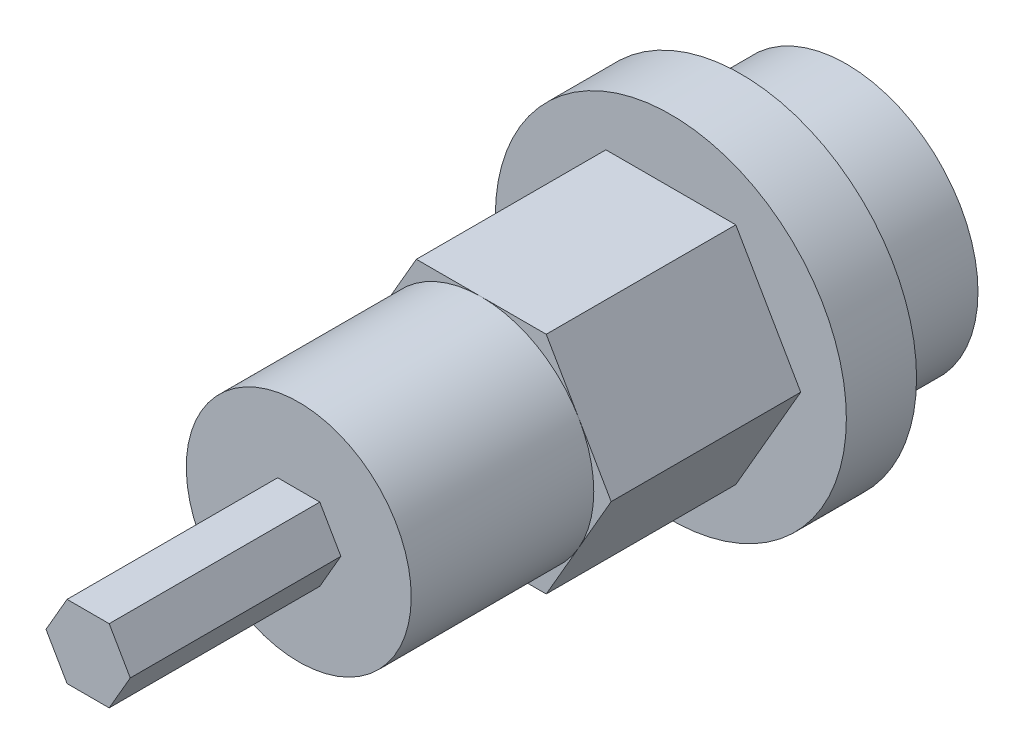
ISO-10303-21;
HEADER;
FILE_DESCRIPTION(('STEP AP214'),'2;1');
FILE_NAME('part.step','',(''),(''),'','','');
FILE_SCHEMA(('AUTOMOTIVE_DESIGN { 1 0 10303 214 1 1 1 1 }'));
ENDSEC;
DATA;
#1=APPLICATION_CONTEXT('core data for automotive mechanical design processes');
#2=APPLICATION_PROTOCOL_DEFINITION('international standard','automotive_design',2000,#1);
#3=PRODUCT_CONTEXT('',#1,'mechanical');
#4=PRODUCT('Part','Part','',(#3));
#5=PRODUCT_RELATED_PRODUCT_CATEGORY('part','',(#4));
#6=PRODUCT_DEFINITION_FORMATION('','',#4);
#7=PRODUCT_DEFINITION_CONTEXT('part definition',#1,'design');
#8=PRODUCT_DEFINITION('design','',#6,#7);
#9=PRODUCT_DEFINITION_SHAPE('','',#8);
#10=(LENGTH_UNIT() NAMED_UNIT(*) SI_UNIT(.MILLI.,.METRE.));
#11=(NAMED_UNIT(*) PLANE_ANGLE_UNIT() SI_UNIT($,.RADIAN.));
#12=(NAMED_UNIT(*) SI_UNIT($,.STERADIAN.) SOLID_ANGLE_UNIT());
#13=UNCERTAINTY_MEASURE_WITH_UNIT(LENGTH_MEASURE(1.E-05),#10,'distance_accuracy_value','');
#14=(GEOMETRIC_REPRESENTATION_CONTEXT(3) GLOBAL_UNCERTAINTY_ASSIGNED_CONTEXT((#13)) GLOBAL_UNIT_ASSIGNED_CONTEXT((#10,
#11,#12)) REPRESENTATION_CONTEXT('',''));
#15=CARTESIAN_POINT('',(0.,0.,0.));
#16=DIRECTION('',(0.,0.,1.));
#17=DIRECTION('',(1.,0.,0.));
#18=AXIS2_PLACEMENT_3D('',#15,#16,#17);
#19=CARTESIAN_POINT('',(0.,0.,10.4));
#20=DIRECTION('',(0.,0.,1.));
#21=DIRECTION('',(1.,0.,0.));
#22=AXIS2_PLACEMENT_3D('',#19,#20,#21);
#23=PLANE('',#22);
#24=CARTESIAN_POINT('',(0.,0.,10.4));
#25=DIRECTION('',(0.,0.,1.));
#26=DIRECTION('',(1.,0.,0.));
#27=AXIS2_PLACEMENT_3D('',#24,#25,#26);
#28=CIRCLE('',#27,3.20429399400242);
#29=CARTESIAN_POINT('',(2.775,1.60214699700121,10.4));
#30=VERTEX_POINT('',#29);
#31=CARTESIAN_POINT('',(0.,3.20429399400243,10.4));
#32=VERTEX_POINT('',#31);
#33=EDGE_CURVE('E51',#30,#32,#28,.T.);
#34=ORIENTED_EDGE('',*,*,#33,.F.);
#35=DIRECTION('',(-0.5,0.866025403784439,0.));
#36=VECTOR('',#35,1.);
#37=CARTESIAN_POINT('',(3.7,0.,10.4));
#38=LINE('',#37,#36);
#39=CARTESIAN_POINT('',(1.85,3.20429399400242,10.4));
#40=VERTEX_POINT('',#39);
#41=EDGE_CURVE('E191',#30,#40,#38,.T.);
#42=ORIENTED_EDGE('',*,*,#41,.T.);
#43=DIRECTION('',(-1.,0.,0.));
#44=VECTOR('',#43,1.);
#45=CARTESIAN_POINT('',(1.85,3.20429399400242,10.4));
#46=LINE('',#45,#44);
#47=EDGE_CURVE('E197',#40,#32,#46,.T.);
#48=ORIENTED_EDGE('',*,*,#47,.T.);
#49=EDGE_LOOP('',(#34,#42,#48));
#50=FACE_BOUND('',#49,.T.);
#51=ADVANCED_FACE('F39',(#50),#23,.T.);
#52=CARTESIAN_POINT('',(-2.775,1.60214699700121,10.4));
#53=VERTEX_POINT('',#52);
#54=EDGE_CURVE('E11',#32,#53,#28,.T.);
#55=ORIENTED_EDGE('',*,*,#54,.F.);
#56=CARTESIAN_POINT('',(-1.85,3.20429399400243,10.4));
#57=VERTEX_POINT('',#56);
#58=EDGE_CURVE('E196',#32,#57,#46,.T.);
#59=ORIENTED_EDGE('',*,*,#58,.T.);
#60=DIRECTION('',(-0.5,-0.866025403784439,0.));
#61=VECTOR('',#60,1.);
#62=CARTESIAN_POINT('',(-1.85,3.20429399400243,10.4));
#63=LINE('',#62,#61);
#64=EDGE_CURVE('E202',#57,#53,#63,.T.);
#65=ORIENTED_EDGE('',*,*,#64,.T.);
#66=EDGE_LOOP('',(#55,#59,#65));
#67=FACE_BOUND('',#66,.T.);
#68=ADVANCED_FACE('F296',(#67),#23,.T.);
#69=CARTESIAN_POINT('',(-2.775,-1.60214699700121,10.4));
#70=VERTEX_POINT('',#69);
#71=EDGE_CURVE('E49',#53,#70,#28,.T.);
#72=ORIENTED_EDGE('',*,*,#71,.F.);
#73=CARTESIAN_POINT('',(-3.7,0.,10.4));
#74=VERTEX_POINT('',#73);
#75=EDGE_CURVE('E201',#53,#74,#63,.T.);
#76=ORIENTED_EDGE('',*,*,#75,.T.);
#77=DIRECTION('',(0.5,-0.866025403784439,0.));
#78=VECTOR('',#77,1.);
#79=CARTESIAN_POINT('',(-3.7,0.,10.4));
#80=LINE('',#79,#78);
#81=EDGE_CURVE('E207',#74,#70,#80,.T.);
#82=ORIENTED_EDGE('',*,*,#81,.T.);
#83=EDGE_LOOP('',(#72,#76,#82));
#84=FACE_BOUND('',#83,.T.);
#85=ADVANCED_FACE('F303',(#84),#23,.T.);
#86=CARTESIAN_POINT('',(0.,-3.20429399400242,10.4));
#87=VERTEX_POINT('',#86);
#88=EDGE_CURVE('E334',#70,#87,#28,.T.);
#89=ORIENTED_EDGE('',*,*,#88,.F.);
#90=CARTESIAN_POINT('',(-1.85,-3.20429399400242,10.4));
#91=VERTEX_POINT('',#90);
#92=EDGE_CURVE('E206',#70,#91,#80,.T.);
#93=ORIENTED_EDGE('',*,*,#92,.T.);
#94=DIRECTION('',(1.,0.,0.));
#95=VECTOR('',#94,1.);
#96=CARTESIAN_POINT('',(-1.85,-3.20429399400242,10.4));
#97=LINE('',#96,#95);
#98=EDGE_CURVE('E212',#91,#87,#97,.T.);
#99=ORIENTED_EDGE('',*,*,#98,.T.);
#100=EDGE_LOOP('',(#89,#93,#99));
#101=FACE_BOUND('',#100,.T.);
#102=ADVANCED_FACE('F321',(#101),#23,.T.);
#103=CARTESIAN_POINT('',(2.775,-1.60214699700121,10.4));
#104=VERTEX_POINT('',#103);
#105=EDGE_CURVE('E278',#87,#104,#28,.T.);
#106=ORIENTED_EDGE('',*,*,#105,.F.);
#107=CARTESIAN_POINT('',(1.85,-3.20429399400243,10.4));
#108=VERTEX_POINT('',#107);
#109=EDGE_CURVE('E211',#87,#108,#97,.T.);
#110=ORIENTED_EDGE('',*,*,#109,.T.);
#111=DIRECTION('',(0.5,0.866025403784439,0.));
#112=VECTOR('',#111,1.);
#113=CARTESIAN_POINT('',(1.85,-3.20429399400243,10.4));
#114=LINE('',#113,#112);
#115=EDGE_CURVE('E187',#108,#104,#114,.T.);
#116=ORIENTED_EDGE('',*,*,#115,.T.);
#117=EDGE_LOOP('',(#106,#110,#116));
#118=FACE_BOUND('',#117,.T.);
#119=ADVANCED_FACE('F293',(#118),#23,.T.);
#120=CARTESIAN_POINT('',(0.,0.,3.));
#121=DIRECTION('',(0.,0.,-1.));
#122=DIRECTION('',(-1.,0.,0.));
#123=AXIS2_PLACEMENT_3D('',#120,#121,#122);
#124=CYLINDRICAL_SURFACE('',#123,3.75);
#125=CARTESIAN_POINT('',(0.,0.,3.));
#126=DIRECTION('',(0.,0.,1.));
#127=DIRECTION('',(1.,0.,0.));
#128=AXIS2_PLACEMENT_3D('',#125,#126,#127);
#129=CIRCLE('',#128,3.75);
#130=CARTESIAN_POINT('',(3.75,0.,3.));
#131=VERTEX_POINT('',#130);
#132=EDGE_CURVE('E270',#131,#131,#129,.T.);
#133=ORIENTED_EDGE('',*,*,#132,.F.);
#134=EDGE_LOOP('',(#133));
#135=FACE_BOUND('',#134,.T.);
#136=CARTESIAN_POINT('',(0.,0.,0.));
#137=DIRECTION('',(0.,0.,1.));
#138=DIRECTION('',(1.,0.,0.));
#139=AXIS2_PLACEMENT_3D('',#136,#137,#138);
#140=CIRCLE('',#139,3.75);
#141=CARTESIAN_POINT('',(3.75,0.,0.));
#142=VERTEX_POINT('',#141);
#143=EDGE_CURVE('E43',#142,#142,#140,.T.);
#144=ORIENTED_EDGE('',*,*,#143,.T.);
#145=EDGE_LOOP('',(#144));
#146=FACE_BOUND('',#145,.T.);
#147=ADVANCED_FACE('F41',(#135,#146),#124,.T.);
#148=CARTESIAN_POINT('',(0.,0.,0.));
#149=DIRECTION('',(0.,0.,1.));
#150=DIRECTION('',(1.,0.,0.));
#151=AXIS2_PLACEMENT_3D('',#148,#149,#150);
#152=PLANE('',#151);
#153=ORIENTED_EDGE('',*,*,#143,.F.);
#154=EDGE_LOOP('',(#153));
#155=FACE_BOUND('',#154,.T.);
#156=ADVANCED_FACE('F283',(#155),#152,.F.);
#157=CARTESIAN_POINT('',(0.,0.,5.));
#158=DIRECTION('',(0.,0.,-1.));
#159=DIRECTION('',(-1.,0.,0.));
#160=AXIS2_PLACEMENT_3D('',#157,#158,#159);
#161=CYLINDRICAL_SURFACE('',#160,5.);
#162=CARTESIAN_POINT('',(0.,0.,5.));
#163=DIRECTION('',(0.,0.,1.));
#164=DIRECTION('',(1.,0.,0.));
#165=AXIS2_PLACEMENT_3D('',#162,#163,#164);
#166=CIRCLE('',#165,5.);
#167=CARTESIAN_POINT('',(5.,0.,5.));
#168=VERTEX_POINT('',#167);
#169=EDGE_CURVE('E264',#168,#168,#166,.T.);
#170=ORIENTED_EDGE('',*,*,#169,.F.);
#171=EDGE_LOOP('',(#170));
#172=FACE_BOUND('',#171,.T.);
#173=CARTESIAN_POINT('',(0.,0.,3.));
#174=DIRECTION('',(0.,0.,1.));
#175=DIRECTION('',(1.,0.,0.));
#176=AXIS2_PLACEMENT_3D('',#173,#174,#175);
#177=CIRCLE('',#176,5.);
#178=CARTESIAN_POINT('',(5.,0.,3.));
#179=VERTEX_POINT('',#178);
#180=EDGE_CURVE('E263',#179,#179,#177,.T.);
#181=ORIENTED_EDGE('',*,*,#180,.T.);
#182=EDGE_LOOP('',(#181));
#183=FACE_BOUND('',#182,.T.);
#184=ADVANCED_FACE('F285',(#172,#183),#161,.T.);
#185=CARTESIAN_POINT('',(0.,0.,5.));
#186=DIRECTION('',(0.,0.,1.));
#187=DIRECTION('',(1.,0.,0.));
#188=AXIS2_PLACEMENT_3D('',#185,#186,#187);
#189=PLANE('',#188);
#190=DIRECTION('',(0.5,0.866025403784439,0.));
#191=VECTOR('',#190,1.);
#192=CARTESIAN_POINT('',(1.85,-3.20429399400243,5.));
#193=LINE('',#192,#191);
#194=CARTESIAN_POINT('',(1.85,-3.20429399400243,5.));
#195=VERTEX_POINT('',#194);
#196=CARTESIAN_POINT('',(3.7,0.,5.));
#197=VERTEX_POINT('',#196);
#198=EDGE_CURVE('E185',#195,#197,#193,.T.);
#199=ORIENTED_EDGE('',*,*,#198,.F.);
#200=DIRECTION('',(1.,0.,0.));
#201=VECTOR('',#200,1.);
#202=CARTESIAN_POINT('',(-1.85,-3.20429399400242,5.));
#203=LINE('',#202,#201);
#204=CARTESIAN_POINT('',(-1.85,-3.20429399400242,5.));
#205=VERTEX_POINT('',#204);
#206=EDGE_CURVE('E236',#205,#195,#203,.T.);
#207=ORIENTED_EDGE('',*,*,#206,.F.);
#208=DIRECTION('',(0.5,-0.866025403784439,0.));
#209=VECTOR('',#208,1.);
#210=CARTESIAN_POINT('',(-3.7,0.,5.));
#211=LINE('',#210,#209);
#212=CARTESIAN_POINT('',(-3.7,0.,5.));
#213=VERTEX_POINT('',#212);
#214=EDGE_CURVE('E232',#213,#205,#211,.T.);
#215=ORIENTED_EDGE('',*,*,#214,.F.);
#216=DIRECTION('',(-0.5,-0.866025403784439,0.));
#217=VECTOR('',#216,1.);
#218=CARTESIAN_POINT('',(-1.85,3.20429399400243,5.));
#219=LINE('',#218,#217);
#220=CARTESIAN_POINT('',(-1.85,3.20429399400243,5.));
#221=VERTEX_POINT('',#220);
#222=EDGE_CURVE('E228',#221,#213,#219,.T.);
#223=ORIENTED_EDGE('',*,*,#222,.F.);
#224=DIRECTION('',(-1.,0.,0.));
#225=VECTOR('',#224,1.);
#226=CARTESIAN_POINT('',(1.85,3.20429399400242,5.));
#227=LINE('',#226,#225);
#228=CARTESIAN_POINT('',(1.85,3.20429399400242,5.));
#229=VERTEX_POINT('',#228);
#230=EDGE_CURVE('E224',#229,#221,#227,.T.);
#231=ORIENTED_EDGE('',*,*,#230,.F.);
#232=DIRECTION('',(-0.5,0.866025403784439,0.));
#233=VECTOR('',#232,1.);
#234=CARTESIAN_POINT('',(3.7,0.,5.));
#235=LINE('',#234,#233);
#236=EDGE_CURVE('E220',#197,#229,#235,.T.);
#237=ORIENTED_EDGE('',*,*,#236,.F.);
#238=EDGE_LOOP('',(#199,#207,#215,#223,#231,#237));
#239=FACE_BOUND('',#238,.T.);
#240=ORIENTED_EDGE('',*,*,#169,.T.);
#241=EDGE_LOOP('',(#240));
#242=FACE_BOUND('',#241,.T.);
#243=ADVANCED_FACE('F290',(#239,#242),#189,.T.);
#244=CARTESIAN_POINT('',(0.,0.,3.));
#245=DIRECTION('',(0.,0.,1.));
#246=DIRECTION('',(1.,0.,0.));
#247=AXIS2_PLACEMENT_3D('',#244,#245,#246);
#248=PLANE('',#247);
#249=ORIENTED_EDGE('',*,*,#132,.T.);
#250=EDGE_LOOP('',(#249));
#251=FACE_BOUND('',#250,.T.);
#252=ORIENTED_EDGE('',*,*,#180,.F.);
#253=EDGE_LOOP('',(#252));
#254=FACE_BOUND('',#253,.T.);
#255=ADVANCED_FACE('F372',(#251,#254),#248,.F.);
#256=CARTESIAN_POINT('',(1.85,-3.20429399400243,10.4));
#257=DIRECTION('',(-0.866025403784439,0.5,0.));
#258=DIRECTION('',(-0.5,-0.866025403784439,0.));
#259=AXIS2_PLACEMENT_3D('',#256,#257,#258);
#260=PLANE('',#259);
#261=ORIENTED_EDGE('',*,*,#198,.T.);
#262=DIRECTION('',(0.,0.,-1.));
#263=VECTOR('',#262,1.);
#264=CARTESIAN_POINT('',(3.7,0.,10.4));
#265=LINE('',#264,#263);
#266=CARTESIAN_POINT('',(3.7,0.,10.4));
#267=VERTEX_POINT('',#266);
#268=EDGE_CURVE('E259',#267,#197,#265,.T.);
#269=ORIENTED_EDGE('',*,*,#268,.F.);
#270=EDGE_CURVE('E192',#104,#267,#114,.T.);
#271=ORIENTED_EDGE('',*,*,#270,.F.);
#272=ORIENTED_EDGE('',*,*,#115,.F.);
#273=DIRECTION('',(0.,0.,-1.));
#274=VECTOR('',#273,1.);
#275=CARTESIAN_POINT('',(1.85,-3.20429399400243,10.4));
#276=LINE('',#275,#274);
#277=EDGE_CURVE('E216',#108,#195,#276,.T.);
#278=ORIENTED_EDGE('',*,*,#277,.T.);
#279=EDGE_LOOP('',(#261,#269,#271,#272,#278));
#280=FACE_BOUND('',#279,.T.);
#281=ADVANCED_FACE('F369',(#280),#260,.F.);
#282=CARTESIAN_POINT('',(3.7,0.,10.4));
#283=DIRECTION('',(-0.866025403784439,-0.5,0.));
#284=DIRECTION('',(0.5,-0.866025403784439,0.));
#285=AXIS2_PLACEMENT_3D('',#282,#283,#284);
#286=PLANE('',#285);
#287=ORIENTED_EDGE('',*,*,#236,.T.);
#288=DIRECTION('',(0.,0.,-1.));
#289=VECTOR('',#288,1.);
#290=CARTESIAN_POINT('',(1.85,3.20429399400242,10.4));
#291=LINE('',#290,#289);
#292=EDGE_CURVE('E255',#40,#229,#291,.T.);
#293=ORIENTED_EDGE('',*,*,#292,.F.);
#294=ORIENTED_EDGE('',*,*,#41,.F.);
#295=EDGE_CURVE('E193',#267,#30,#38,.T.);
#296=ORIENTED_EDGE('',*,*,#295,.F.);
#297=ORIENTED_EDGE('',*,*,#268,.T.);
#298=EDGE_LOOP('',(#287,#293,#294,#296,#297));
#299=FACE_BOUND('',#298,.T.);
#300=ADVANCED_FACE('F367',(#299),#286,.F.);
#301=CARTESIAN_POINT('',(1.85,3.20429399400242,10.4));
#302=DIRECTION('',(0.,-1.,0.));
#303=DIRECTION('',(1.,0.,0.));
#304=AXIS2_PLACEMENT_3D('',#301,#302,#303);
#305=PLANE('',#304);
#306=ORIENTED_EDGE('',*,*,#230,.T.);
#307=DIRECTION('',(0.,0.,-1.));
#308=VECTOR('',#307,1.);
#309=CARTESIAN_POINT('',(-1.85,3.20429399400243,10.4));
#310=LINE('',#309,#308);
#311=EDGE_CURVE('E251',#57,#221,#310,.T.);
#312=ORIENTED_EDGE('',*,*,#311,.F.);
#313=ORIENTED_EDGE('',*,*,#58,.F.);
#314=ORIENTED_EDGE('',*,*,#47,.F.);
#315=ORIENTED_EDGE('',*,*,#292,.T.);
#316=EDGE_LOOP('',(#306,#312,#313,#314,#315));
#317=FACE_BOUND('',#316,.T.);
#318=ADVANCED_FACE('F355',(#317),#305,.F.);
#319=CARTESIAN_POINT('',(-1.85,3.20429399400243,10.4));
#320=DIRECTION('',(0.866025403784439,-0.5,0.));
#321=DIRECTION('',(0.5,0.866025403784439,0.));
#322=AXIS2_PLACEMENT_3D('',#319,#320,#321);
#323=PLANE('',#322);
#324=ORIENTED_EDGE('',*,*,#222,.T.);
#325=DIRECTION('',(0.,0.,-1.));
#326=VECTOR('',#325,1.);
#327=CARTESIAN_POINT('',(-3.7,0.,10.4));
#328=LINE('',#327,#326);
#329=EDGE_CURVE('E247',#74,#213,#328,.T.);
#330=ORIENTED_EDGE('',*,*,#329,.F.);
#331=ORIENTED_EDGE('',*,*,#75,.F.);
#332=ORIENTED_EDGE('',*,*,#64,.F.);
#333=ORIENTED_EDGE('',*,*,#311,.T.);
#334=EDGE_LOOP('',(#324,#330,#331,#332,#333));
#335=FACE_BOUND('',#334,.T.);
#336=ADVANCED_FACE('F348',(#335),#323,.F.);
#337=CARTESIAN_POINT('',(-3.7,0.,10.4));
#338=DIRECTION('',(0.866025403784439,0.5,0.));
#339=DIRECTION('',(-0.5,0.866025403784439,0.));
#340=AXIS2_PLACEMENT_3D('',#337,#338,#339);
#341=PLANE('',#340);
#342=ORIENTED_EDGE('',*,*,#214,.T.);
#343=DIRECTION('',(0.,0.,-1.));
#344=VECTOR('',#343,1.);
#345=CARTESIAN_POINT('',(-1.85,-3.20429399400242,10.4));
#346=LINE('',#345,#344);
#347=EDGE_CURVE('E243',#91,#205,#346,.T.);
#348=ORIENTED_EDGE('',*,*,#347,.F.);
#349=ORIENTED_EDGE('',*,*,#92,.F.);
#350=ORIENTED_EDGE('',*,*,#81,.F.);
#351=ORIENTED_EDGE('',*,*,#329,.T.);
#352=EDGE_LOOP('',(#342,#348,#349,#350,#351));
#353=FACE_BOUND('',#352,.T.);
#354=ADVANCED_FACE('F318',(#353),#341,.F.);
#355=CARTESIAN_POINT('',(-1.85,-3.20429399400242,10.4));
#356=DIRECTION('',(0.,1.,0.));
#357=DIRECTION('',(-1.,0.,0.));
#358=AXIS2_PLACEMENT_3D('',#355,#356,#357);
#359=PLANE('',#358);
#360=ORIENTED_EDGE('',*,*,#206,.T.);
#361=ORIENTED_EDGE('',*,*,#277,.F.);
#362=ORIENTED_EDGE('',*,*,#109,.F.);
#363=ORIENTED_EDGE('',*,*,#98,.F.);
#364=ORIENTED_EDGE('',*,*,#347,.T.);
#365=EDGE_LOOP('',(#360,#361,#362,#363,#364));
#366=FACE_BOUND('',#365,.T.);
#367=ADVANCED_FACE('F310',(#366),#359,.F.);
#368=EDGE_CURVE('E178',#104,#30,#28,.T.);
#369=ORIENTED_EDGE('',*,*,#368,.F.);
#370=ORIENTED_EDGE('',*,*,#270,.T.);
#371=ORIENTED_EDGE('',*,*,#295,.T.);
#372=EDGE_LOOP('',(#369,#370,#371));
#373=FACE_BOUND('',#372,.T.);
#374=ADVANCED_FACE('F299',(#373),#23,.T.);
#375=CARTESIAN_POINT('',(0.,0.,15.6));
#376=DIRECTION('',(0.,0.,-1.));
#377=DIRECTION('',(-1.,0.,0.));
#378=AXIS2_PLACEMENT_3D('',#375,#376,#377);
#379=CYLINDRICAL_SURFACE('',#378,3.20429399400242);
#380=CARTESIAN_POINT('',(0.,0.,15.6));
#381=DIRECTION('',(0.,0.,1.));
#382=DIRECTION('',(1.,0.,0.));
#383=AXIS2_PLACEMENT_3D('',#380,#381,#382);
#384=CIRCLE('',#383,3.20429399400242);
#385=CARTESIAN_POINT('',(3.20429399400242,0.,15.6));
#386=VERTEX_POINT('',#385);
#387=EDGE_CURVE('E177',#386,#386,#384,.T.);
#388=ORIENTED_EDGE('',*,*,#387,.F.);
#389=EDGE_LOOP('',(#388));
#390=FACE_BOUND('',#389,.T.);
#391=ORIENTED_EDGE('',*,*,#33,.T.);
#392=ORIENTED_EDGE('',*,*,#54,.T.);
#393=ORIENTED_EDGE('',*,*,#71,.T.);
#394=ORIENTED_EDGE('',*,*,#88,.T.);
#395=ORIENTED_EDGE('',*,*,#105,.T.);
#396=ORIENTED_EDGE('',*,*,#368,.T.);
#397=EDGE_LOOP('',(#391,#392,#393,#394,#395,#396));
#398=FACE_BOUND('',#397,.T.);
#399=ADVANCED_FACE('F309',(#390,#398),#379,.T.);
#400=CARTESIAN_POINT('',(0.,0.,15.6));
#401=DIRECTION('',(0.,0.,1.));
#402=DIRECTION('',(1.,0.,0.));
#403=AXIS2_PLACEMENT_3D('',#400,#401,#402);
#404=PLANE('',#403);
#405=DIRECTION('',(0.5,0.866025403784439,0.));
#406=VECTOR('',#405,1.);
#407=CARTESIAN_POINT('',(0.599999999999999,-1.03923048454133,15.6));
#408=LINE('',#407,#406);
#409=CARTESIAN_POINT('',(0.599999999999999,-1.03923048454133,15.6));
#410=VERTEX_POINT('',#409);
#411=CARTESIAN_POINT('',(1.2,0.,15.6));
#412=VERTEX_POINT('',#411);
#413=EDGE_CURVE('E58',#410,#412,#408,.T.);
#414=ORIENTED_EDGE('',*,*,#413,.F.);
#415=DIRECTION('',(1.,0.,0.));
#416=VECTOR('',#415,1.);
#417=CARTESIAN_POINT('',(-0.6,-1.03923048454133,15.6));
#418=LINE('',#417,#416);
#419=CARTESIAN_POINT('',(-0.6,-1.03923048454133,15.6));
#420=VERTEX_POINT('',#419);
#421=EDGE_CURVE('E62',#420,#410,#418,.T.);
#422=ORIENTED_EDGE('',*,*,#421,.F.);
#423=DIRECTION('',(0.5,-0.866025403784439,0.));
#424=VECTOR('',#423,1.);
#425=CARTESIAN_POINT('',(-1.2,0.,15.6));
#426=LINE('',#425,#424);
#427=CARTESIAN_POINT('',(-1.2,0.,15.6));
#428=VERTEX_POINT('',#427);
#429=EDGE_CURVE('E493',#428,#420,#426,.T.);
#430=ORIENTED_EDGE('',*,*,#429,.F.);
#431=DIRECTION('',(-0.5,-0.866025403784439,0.));
#432=VECTOR('',#431,1.);
#433=CARTESIAN_POINT('',(-0.6,1.03923048454133,15.6));
#434=LINE('',#433,#432);
#435=CARTESIAN_POINT('',(-0.6,1.03923048454133,15.6));
#436=VERTEX_POINT('',#435);
#437=EDGE_CURVE('E513',#436,#428,#434,.T.);
#438=ORIENTED_EDGE('',*,*,#437,.F.);
#439=DIRECTION('',(-1.,0.,0.));
#440=VECTOR('',#439,1.);
#441=CARTESIAN_POINT('',(0.6,1.03923048454133,15.6));
#442=LINE('',#441,#440);
#443=CARTESIAN_POINT('',(0.6,1.03923048454133,15.6));
#444=VERTEX_POINT('',#443);
#445=EDGE_CURVE('E516',#444,#436,#442,.T.);
#446=ORIENTED_EDGE('',*,*,#445,.F.);
#447=DIRECTION('',(-0.5,0.866025403784439,0.));
#448=VECTOR('',#447,1.);
#449=CARTESIAN_POINT('',(1.2,0.,15.6));
#450=LINE('',#449,#448);
#451=EDGE_CURVE('E518',#412,#444,#450,.T.);
#452=ORIENTED_EDGE('',*,*,#451,.F.);
#453=EDGE_LOOP('',(#414,#422,#430,#438,#446,#452));
#454=FACE_BOUND('',#453,.T.);
#455=ORIENTED_EDGE('',*,*,#387,.T.);
#456=EDGE_LOOP('',(#455));
#457=FACE_BOUND('',#456,.T.);
#458=ADVANCED_FACE('F316',(#454,#457),#404,.T.);
#459=CARTESIAN_POINT('',(0.599999999999999,-1.03923048454133,21.6));
#460=DIRECTION('',(-0.866025403784439,0.5,0.));
#461=DIRECTION('',(-0.5,-0.866025403784439,0.));
#462=AXIS2_PLACEMENT_3D('',#459,#460,#461);
#463=PLANE('',#462);
#464=ORIENTED_EDGE('',*,*,#413,.T.);
#465=DIRECTION('',(0.,0.,-1.));
#466=VECTOR('',#465,1.);
#467=CARTESIAN_POINT('',(1.2,0.,21.6));
#468=LINE('',#467,#466);
#469=CARTESIAN_POINT('',(1.2,0.,21.6));
#470=VERTEX_POINT('',#469);
#471=EDGE_CURVE('E153',#470,#412,#468,.T.);
#472=ORIENTED_EDGE('',*,*,#471,.F.);
#473=DIRECTION('',(0.5,0.866025403784439,0.));
#474=VECTOR('',#473,1.);
#475=CARTESIAN_POINT('',(0.599999999999999,-1.03923048454133,21.6));
#476=LINE('',#475,#474);
#477=CARTESIAN_POINT('',(0.599999999999999,-1.03923048454133,21.6));
#478=VERTEX_POINT('',#477);
#479=EDGE_CURVE('E160',#478,#470,#476,.T.);
#480=ORIENTED_EDGE('',*,*,#479,.F.);
#481=DIRECTION('',(0.,0.,-1.));
#482=VECTOR('',#481,1.);
#483=CARTESIAN_POINT('',(0.599999999999999,-1.03923048454133,21.6));
#484=LINE('',#483,#482);
#485=EDGE_CURVE('E489',#478,#410,#484,.T.);
#486=ORIENTED_EDGE('',*,*,#485,.T.);
#487=EDGE_LOOP('',(#464,#472,#480,#486));
#488=FACE_BOUND('',#487,.T.);
#489=ADVANCED_FACE('F171',(#488),#463,.F.);
#490=CARTESIAN_POINT('',(1.2,0.,21.6));
#491=DIRECTION('',(-0.866025403784439,-0.5,0.));
#492=DIRECTION('',(0.5,-0.866025403784439,0.));
#493=AXIS2_PLACEMENT_3D('',#490,#491,#492);
#494=PLANE('',#493);
#495=ORIENTED_EDGE('',*,*,#451,.T.);
#496=DIRECTION('',(0.,0.,-1.));
#497=VECTOR('',#496,1.);
#498=CARTESIAN_POINT('',(0.6,1.03923048454133,21.6));
#499=LINE('',#498,#497);
#500=CARTESIAN_POINT('',(0.6,1.03923048454133,21.6));
#501=VERTEX_POINT('',#500);
#502=EDGE_CURVE('E155',#501,#444,#499,.T.);
#503=ORIENTED_EDGE('',*,*,#502,.F.);
#504=DIRECTION('',(-0.5,0.866025403784439,0.));
#505=VECTOR('',#504,1.);
#506=CARTESIAN_POINT('',(1.2,0.,21.6));
#507=LINE('',#506,#505);
#508=EDGE_CURVE('E148',#470,#501,#507,.T.);
#509=ORIENTED_EDGE('',*,*,#508,.F.);
#510=ORIENTED_EDGE('',*,*,#471,.T.);
#511=EDGE_LOOP('',(#495,#503,#509,#510));
#512=FACE_BOUND('',#511,.T.);
#513=ADVANCED_FACE('F151',(#512),#494,.F.);
#514=CARTESIAN_POINT('',(0.6,1.03923048454133,21.6));
#515=DIRECTION('',(0.,-1.,0.));
#516=DIRECTION('',(1.,0.,0.));
#517=AXIS2_PLACEMENT_3D('',#514,#515,#516);
#518=PLANE('',#517);
#519=ORIENTED_EDGE('',*,*,#445,.T.);
#520=DIRECTION('',(0.,0.,-1.));
#521=VECTOR('',#520,1.);
#522=CARTESIAN_POINT('',(-0.6,1.03923048454133,21.6));
#523=LINE('',#522,#521);
#524=CARTESIAN_POINT('',(-0.6,1.03923048454133,21.6));
#525=VERTEX_POINT('',#524);
#526=EDGE_CURVE('E179',#525,#436,#523,.T.);
#527=ORIENTED_EDGE('',*,*,#526,.F.);
#528=DIRECTION('',(-1.,0.,0.));
#529=VECTOR('',#528,1.);
#530=CARTESIAN_POINT('',(0.6,1.03923048454133,21.6));
#531=LINE('',#530,#529);
#532=EDGE_CURVE('E159',#501,#525,#531,.T.);
#533=ORIENTED_EDGE('',*,*,#532,.F.);
#534=ORIENTED_EDGE('',*,*,#502,.T.);
#535=EDGE_LOOP('',(#519,#527,#533,#534));
#536=FACE_BOUND('',#535,.T.);
#537=ADVANCED_FACE('F437',(#536),#518,.F.);
#538=CARTESIAN_POINT('',(-0.6,1.03923048454133,21.6));
#539=DIRECTION('',(0.866025403784438,-0.5,0.));
#540=DIRECTION('',(0.5,0.866025403784439,0.));
#541=AXIS2_PLACEMENT_3D('',#538,#539,#540);
#542=PLANE('',#541);
#543=ORIENTED_EDGE('',*,*,#437,.T.);
#544=DIRECTION('',(0.,0.,-1.));
#545=VECTOR('',#544,1.);
#546=CARTESIAN_POINT('',(-1.2,0.,21.6));
#547=LINE('',#546,#545);
#548=CARTESIAN_POINT('',(-1.2,0.,21.6));
#549=VERTEX_POINT('',#548);
#550=EDGE_CURVE('E499',#549,#428,#547,.T.);
#551=ORIENTED_EDGE('',*,*,#550,.F.);
#552=DIRECTION('',(-0.5,-0.866025403784439,0.));
#553=VECTOR('',#552,1.);
#554=CARTESIAN_POINT('',(-0.6,1.03923048454133,21.6));
#555=LINE('',#554,#553);
#556=EDGE_CURVE('E514',#525,#549,#555,.T.);
#557=ORIENTED_EDGE('',*,*,#556,.F.);
#558=ORIENTED_EDGE('',*,*,#526,.T.);
#559=EDGE_LOOP('',(#543,#551,#557,#558));
#560=FACE_BOUND('',#559,.T.);
#561=ADVANCED_FACE('F446',(#560),#542,.F.);
#562=CARTESIAN_POINT('',(-1.2,0.,21.6));
#563=DIRECTION('',(0.866025403784439,0.5,0.));
#564=DIRECTION('',(-0.5,0.866025403784439,0.));
#565=AXIS2_PLACEMENT_3D('',#562,#563,#564);
#566=PLANE('',#565);
#567=ORIENTED_EDGE('',*,*,#429,.T.);
#568=DIRECTION('',(0.,0.,-1.));
#569=VECTOR('',#568,1.);
#570=CARTESIAN_POINT('',(-0.6,-1.03923048454133,21.6));
#571=LINE('',#570,#569);
#572=CARTESIAN_POINT('',(-0.6,-1.03923048454133,21.6));
#573=VERTEX_POINT('',#572);
#574=EDGE_CURVE('E491',#573,#420,#571,.T.);
#575=ORIENTED_EDGE('',*,*,#574,.F.);
#576=DIRECTION('',(0.5,-0.866025403784439,0.));
#577=VECTOR('',#576,1.);
#578=CARTESIAN_POINT('',(-1.2,0.,21.6));
#579=LINE('',#578,#577);
#580=EDGE_CURVE('E501',#549,#573,#579,.T.);
#581=ORIENTED_EDGE('',*,*,#580,.F.);
#582=ORIENTED_EDGE('',*,*,#550,.T.);
#583=EDGE_LOOP('',(#567,#575,#581,#582));
#584=FACE_BOUND('',#583,.T.);
#585=ADVANCED_FACE('F456',(#584),#566,.F.);
#586=CARTESIAN_POINT('',(-0.6,-1.03923048454133,21.6));
#587=DIRECTION('',(0.,1.,0.));
#588=DIRECTION('',(-1.,0.,0.));
#589=AXIS2_PLACEMENT_3D('',#586,#587,#588);
#590=PLANE('',#589);
#591=ORIENTED_EDGE('',*,*,#421,.T.);
#592=ORIENTED_EDGE('',*,*,#485,.F.);
#593=DIRECTION('',(1.,0.,0.));
#594=VECTOR('',#593,1.);
#595=CARTESIAN_POINT('',(-0.6,-1.03923048454133,21.6));
#596=LINE('',#595,#594);
#597=EDGE_CURVE('E165',#573,#478,#596,.T.);
#598=ORIENTED_EDGE('',*,*,#597,.F.);
#599=ORIENTED_EDGE('',*,*,#574,.T.);
#600=EDGE_LOOP('',(#591,#592,#598,#599));
#601=FACE_BOUND('',#600,.T.);
#602=ADVANCED_FACE('F466',(#601),#590,.F.);
#603=CARTESIAN_POINT('',(0.,0.,21.6));
#604=DIRECTION('',(0.,0.,1.));
#605=DIRECTION('',(1.,0.,0.));
#606=AXIS2_PLACEMENT_3D('',#603,#604,#605);
#607=PLANE('',#606);
#608=ORIENTED_EDGE('',*,*,#479,.T.);
#609=ORIENTED_EDGE('',*,*,#508,.T.);
#610=ORIENTED_EDGE('',*,*,#532,.T.);
#611=ORIENTED_EDGE('',*,*,#556,.T.);
#612=ORIENTED_EDGE('',*,*,#580,.T.);
#613=ORIENTED_EDGE('',*,*,#597,.T.);
#614=EDGE_LOOP('',(#608,#609,#610,#611,#612,#613));
#615=FACE_BOUND('',#614,.T.);
#616=ADVANCED_FACE('F163',(#615),#607,.T.);
#617=CLOSED_SHELL('',(#51,#68,#85,#102,#119,#147,#156,#184,#243,#255,#281,#300,#318,#336,#354,
#367,#374,#399,#458,#489,#513,#537,#561,#585,#602,#616));
#618=MANIFOLD_SOLID_BREP('B2',#617);
#619=ADVANCED_BREP_SHAPE_REPRESENTATION('',(#18,#618),#14);
#620=SHAPE_DEFINITION_REPRESENTATION(#9,#619);
ENDSEC;
END-ISO-10303-21;
